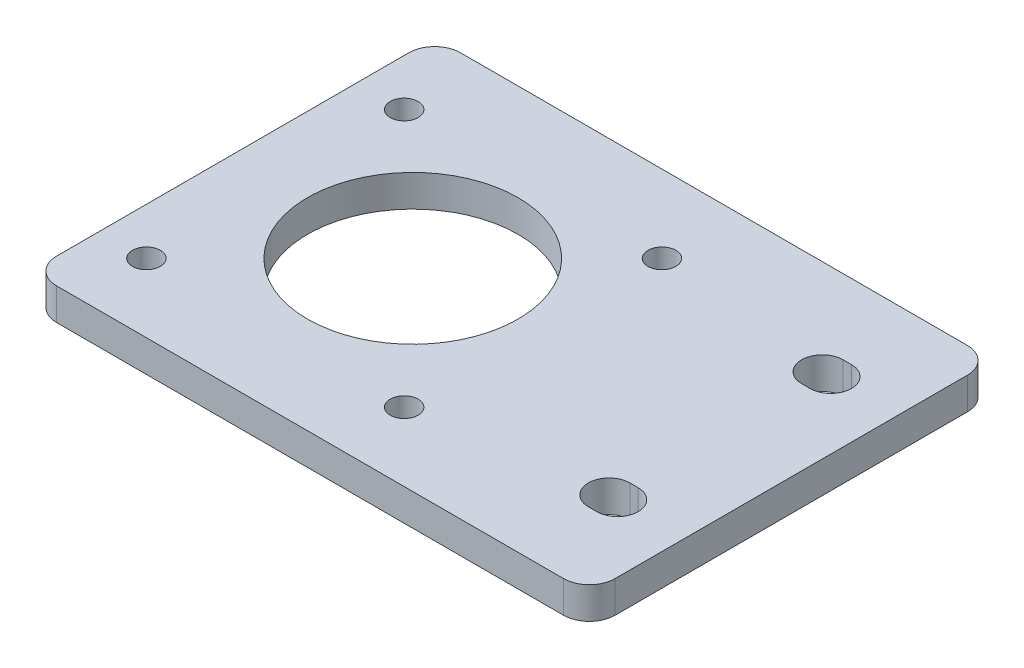
ISO-10303-21;
HEADER;
FILE_DESCRIPTION(('STEP AP214'),'2;1');
FILE_NAME('part.step','',(''),(''),'','','');
FILE_SCHEMA(('AUTOMOTIVE_DESIGN { 1 0 10303 214 1 1 1 1 }'));
ENDSEC;
DATA;
#1=APPLICATION_CONTEXT('core data for automotive mechanical design processes');
#2=APPLICATION_PROTOCOL_DEFINITION('international standard','automotive_design',2000,#1);
#3=PRODUCT_CONTEXT('',#1,'mechanical');
#4=PRODUCT('Part','Part','',(#3));
#5=PRODUCT_RELATED_PRODUCT_CATEGORY('part','',(#4));
#6=PRODUCT_DEFINITION_FORMATION('','',#4);
#7=PRODUCT_DEFINITION_CONTEXT('part definition',#1,'design');
#8=PRODUCT_DEFINITION('design','',#6,#7);
#9=PRODUCT_DEFINITION_SHAPE('','',#8);
#10=(LENGTH_UNIT() NAMED_UNIT(*) SI_UNIT(.MILLI.,.METRE.));
#11=(NAMED_UNIT(*) PLANE_ANGLE_UNIT() SI_UNIT($,.RADIAN.));
#12=(NAMED_UNIT(*) SI_UNIT($,.STERADIAN.) SOLID_ANGLE_UNIT());
#13=UNCERTAINTY_MEASURE_WITH_UNIT(LENGTH_MEASURE(1.E-05),#10,'distance_accuracy_value','');
#14=(GEOMETRIC_REPRESENTATION_CONTEXT(3) GLOBAL_UNCERTAINTY_ASSIGNED_CONTEXT((#13)) GLOBAL_UNIT_ASSIGNED_CONTEXT((#10,
#11,#12)) REPRESENTATION_CONTEXT('',''));
#15=CARTESIAN_POINT('',(0.,0.,0.));
#16=DIRECTION('',(0.,0.,1.));
#17=DIRECTION('',(1.,0.,0.));
#18=AXIS2_PLACEMENT_3D('',#15,#16,#17);
#19=CARTESIAN_POINT('',(0.,3.7,0.));
#20=DIRECTION('',(0.,-1.,0.));
#21=DIRECTION('',(0.,0.,-1.));
#22=AXIS2_PLACEMENT_3D('',#19,#20,#21);
#23=PLANE('',#22);
#24=CARTESIAN_POINT('',(39.3569900361446,3.7,1.63237025517979));
#25=DIRECTION('',(0.,1.,0.));
#26=DIRECTION('',(0.,0.,1.));
#27=AXIS2_PLACEMENT_3D('',#24,#25,#26);
#28=CIRCLE('',#27,2.41000000000001);
#29=CARTESIAN_POINT('',(39.3569900361446,3.7,-0.777629744820214));
#30=VERTEX_POINT('',#29);
#31=CARTESIAN_POINT('',(39.3569900361446,3.7,4.0423702551798));
#32=VERTEX_POINT('',#31);
#33=EDGE_CURVE('E190',#30,#32,#28,.T.);
#34=ORIENTED_EDGE('',*,*,#33,.F.);
#35=DIRECTION('',(-1.,0.,0.));
#36=VECTOR('',#35,1.);
#37=CARTESIAN_POINT('',(39.3569900361446,3.7,-0.777629744820214));
#38=LINE('',#37,#36);
#39=CARTESIAN_POINT('',(40.3369900361446,3.7,-0.777629744820207));
#40=VERTEX_POINT('',#39);
#41=EDGE_CURVE('E198',#40,#30,#38,.T.);
#42=ORIENTED_EDGE('',*,*,#41,.F.);
#43=CARTESIAN_POINT('',(40.3369900361446,3.7,1.63237025517979));
#44=DIRECTION('',(0.,1.,0.));
#45=DIRECTION('',(0.,0.,1.));
#46=AXIS2_PLACEMENT_3D('',#43,#44,#45);
#47=CIRCLE('',#46,2.41);
#48=CARTESIAN_POINT('',(40.3369900361446,3.7,4.04237025517979));
#49=VERTEX_POINT('',#48);
#50=EDGE_CURVE('E195',#49,#40,#47,.T.);
#51=ORIENTED_EDGE('',*,*,#50,.F.);
#52=DIRECTION('',(1.,0.,0.));
#53=VECTOR('',#52,1.);
#54=CARTESIAN_POINT('',(39.3569900361446,3.7,4.0423702551798));
#55=LINE('',#54,#53);
#56=EDGE_CURVE('E192',#32,#49,#55,.T.);
#57=ORIENTED_EDGE('',*,*,#56,.F.);
#58=EDGE_LOOP('',(#34,#42,#51,#57));
#59=FACE_BOUND('',#58,.T.);
#60=DIRECTION('',(-1.,0.,0.));
#61=VECTOR('',#60,1.);
#62=CARTESIAN_POINT('',(-16.8530099638554,3.7,-34.2776297448202));
#63=LINE('',#62,#61);
#64=CARTESIAN_POINT('',(45.1469900361446,3.7,-34.2776297448202));
#65=VERTEX_POINT('',#64);
#66=CARTESIAN_POINT('',(-13.8530099638554,3.7,-34.2776297448202));
#67=VERTEX_POINT('',#66);
#68=EDGE_CURVE('E259',#65,#67,#63,.T.);
#69=ORIENTED_EDGE('',*,*,#68,.T.);
#70=CARTESIAN_POINT('',(-13.8530099638554,3.7,-31.2776297448202));
#71=DIRECTION('',(0.,-1.,0.));
#72=DIRECTION('',(0.,0.,-1.));
#73=AXIS2_PLACEMENT_3D('',#70,#71,#72);
#74=CIRCLE('',#73,3.);
#75=CARTESIAN_POINT('',(-16.8530099638554,3.7,-31.2776297448202));
#76=VERTEX_POINT('',#75);
#77=EDGE_CURVE('E294',#67,#76,#74,.F.);
#78=ORIENTED_EDGE('',*,*,#77,.T.);
#79=DIRECTION('',(0.,0.,1.));
#80=VECTOR('',#79,1.);
#81=CARTESIAN_POINT('',(-16.8530099638554,3.7,12.7223702551798));
#82=LINE('',#81,#80);
#83=CARTESIAN_POINT('',(-16.8530099638554,3.7,9.72237025517979));
#84=VERTEX_POINT('',#83);
#85=EDGE_CURVE('E251',#76,#84,#82,.T.);
#86=ORIENTED_EDGE('',*,*,#85,.T.);
#87=CARTESIAN_POINT('',(-13.8530099638554,3.7,9.72237025517979));
#88=DIRECTION('',(0.,-1.,0.));
#89=DIRECTION('',(0.,0.,-1.));
#90=AXIS2_PLACEMENT_3D('',#87,#88,#89);
#91=CIRCLE('',#90,3.);
#92=CARTESIAN_POINT('',(-13.8530099638554,3.7,12.7223702551798));
#93=VERTEX_POINT('',#92);
#94=EDGE_CURVE('E290',#84,#93,#91,.F.);
#95=ORIENTED_EDGE('',*,*,#94,.T.);
#96=DIRECTION('',(1.,0.,0.));
#97=VECTOR('',#96,1.);
#98=CARTESIAN_POINT('',(-16.8530099638554,3.7,12.7223702551798));
#99=LINE('',#98,#97);
#100=CARTESIAN_POINT('',(45.1469900361446,3.7,12.7223702551798));
#101=VERTEX_POINT('',#100);
#102=EDGE_CURVE('E254',#93,#101,#99,.T.);
#103=ORIENTED_EDGE('',*,*,#102,.T.);
#104=CARTESIAN_POINT('',(45.1469900361446,3.7,9.72237025517979));
#105=DIRECTION('',(0.,-1.,0.));
#106=DIRECTION('',(0.,0.,-1.));
#107=AXIS2_PLACEMENT_3D('',#104,#105,#106);
#108=CIRCLE('',#107,3.);
#109=CARTESIAN_POINT('',(48.1469900361446,3.7,9.72237025517979));
#110=VERTEX_POINT('',#109);
#111=EDGE_CURVE('E55',#101,#110,#108,.F.);
#112=ORIENTED_EDGE('',*,*,#111,.T.);
#113=DIRECTION('',(0.,0.,-1.));
#114=VECTOR('',#113,1.);
#115=CARTESIAN_POINT('',(48.1469900361446,3.7,12.7223702551798));
#116=LINE('',#115,#114);
#117=CARTESIAN_POINT('',(48.1469900361446,3.7,-31.2776297448202));
#118=VERTEX_POINT('',#117);
#119=EDGE_CURVE('E257',#110,#118,#116,.T.);
#120=ORIENTED_EDGE('',*,*,#119,.T.);
#121=CARTESIAN_POINT('',(45.1469900361446,3.7,-31.2776297448202));
#122=DIRECTION('',(0.,-1.,0.));
#123=DIRECTION('',(0.,0.,-1.));
#124=AXIS2_PLACEMENT_3D('',#121,#122,#123);
#125=CIRCLE('',#124,3.);
#126=EDGE_CURVE('E292',#118,#65,#125,.F.);
#127=ORIENTED_EDGE('',*,*,#126,.T.);
#128=EDGE_LOOP('',(#69,#78,#86,#95,#103,#112,#120,#127));
#129=FACE_BOUND('',#128,.T.);
#130=CARTESIAN_POINT('',(4.09699003614461,3.7,-10.7776297448202));
#131=DIRECTION('',(0.,1.,0.));
#132=DIRECTION('',(0.,0.,1.));
#133=AXIS2_PLACEMENT_3D('',#130,#131,#132);
#134=CIRCLE('',#133,12.25);
#135=CARTESIAN_POINT('',(4.09699003614461,3.7,1.47237025517979));
#136=VERTEX_POINT('',#135);
#137=EDGE_CURVE('E245',#136,#136,#134,.T.);
#138=ORIENTED_EDGE('',*,*,#137,.F.);
#139=EDGE_LOOP('',(#138));
#140=FACE_BOUND('',#139,.T.);
#141=CARTESIAN_POINT('',(-11.4030099638554,3.7,4.72237025517979));
#142=DIRECTION('',(0.,1.,0.));
#143=DIRECTION('',(0.,0.,1.));
#144=AXIS2_PLACEMENT_3D('',#141,#142,#143);
#145=CIRCLE('',#144,1.62384984749867);
#146=CARTESIAN_POINT('',(-11.4030099638554,3.7,6.34622010267846));
#147=VERTEX_POINT('',#146);
#148=EDGE_CURVE('E239',#147,#147,#145,.T.);
#149=ORIENTED_EDGE('',*,*,#148,.F.);
#150=EDGE_LOOP('',(#149));
#151=FACE_BOUND('',#150,.T.);
#152=CARTESIAN_POINT('',(18.5969900361446,3.7,4.72237025517979));
#153=DIRECTION('',(0.,1.,0.));
#154=DIRECTION('',(0.,0.,1.));
#155=AXIS2_PLACEMENT_3D('',#152,#153,#154);
#156=CIRCLE('',#155,1.62384984749867);
#157=CARTESIAN_POINT('',(18.5969900361446,3.7,6.34622010267846));
#158=VERTEX_POINT('',#157);
#159=EDGE_CURVE('E233',#158,#158,#156,.T.);
#160=ORIENTED_EDGE('',*,*,#159,.F.);
#161=EDGE_LOOP('',(#160));
#162=FACE_BOUND('',#161,.T.);
#163=CARTESIAN_POINT('',(18.5969900361445,3.7,-25.2776297448202));
#164=DIRECTION('',(0.,1.,0.));
#165=DIRECTION('',(0.,0.,1.));
#166=AXIS2_PLACEMENT_3D('',#163,#164,#165);
#167=CIRCLE('',#166,1.62384984749867);
#168=CARTESIAN_POINT('',(18.5969900361445,3.7,-23.6537798973215));
#169=VERTEX_POINT('',#168);
#170=EDGE_CURVE('E227',#169,#169,#167,.T.);
#171=ORIENTED_EDGE('',*,*,#170,.F.);
#172=EDGE_LOOP('',(#171));
#173=FACE_BOUND('',#172,.T.);
#174=CARTESIAN_POINT('',(-11.4030099638555,3.7,-25.2776297448202));
#175=DIRECTION('',(0.,1.,0.));
#176=DIRECTION('',(0.,0.,1.));
#177=AXIS2_PLACEMENT_3D('',#174,#175,#176);
#178=CIRCLE('',#177,1.62384984749867);
#179=CARTESIAN_POINT('',(-11.4030099638555,3.7,-23.6537798973215));
#180=VERTEX_POINT('',#179);
#181=EDGE_CURVE('E221',#180,#180,#178,.T.);
#182=ORIENTED_EDGE('',*,*,#181,.F.);
#183=EDGE_LOOP('',(#182));
#184=FACE_BOUND('',#183,.T.);
#185=CARTESIAN_POINT('',(39.3569900361446,3.7,-23.1876297448202));
#186=DIRECTION('',(0.,1.,0.));
#187=DIRECTION('',(0.,0.,-1.));
#188=AXIS2_PLACEMENT_3D('',#185,#186,#187);
#189=CIRCLE('',#188,2.41);
#190=CARTESIAN_POINT('',(39.3569900361446,3.7,-25.5976297448202));
#191=VERTEX_POINT('',#190);
#192=CARTESIAN_POINT('',(39.3569900361446,3.7,-20.7776297448202));
#193=VERTEX_POINT('',#192);
#194=EDGE_CURVE('E149',#191,#193,#189,.T.);
#195=ORIENTED_EDGE('',*,*,#194,.F.);
#196=DIRECTION('',(-1.,0.,0.));
#197=VECTOR('',#196,1.);
#198=CARTESIAN_POINT('',(39.3569900361446,3.7,-25.5976297448202));
#199=LINE('',#198,#197);
#200=CARTESIAN_POINT('',(40.3369900361446,3.7,-25.5976297448202));
#201=VERTEX_POINT('',#200);
#202=EDGE_CURVE('E174',#201,#191,#199,.T.);
#203=ORIENTED_EDGE('',*,*,#202,.F.);
#204=CARTESIAN_POINT('',(40.3369900361446,3.7,-23.1876297448202));
#205=DIRECTION('',(0.,1.,0.));
#206=DIRECTION('',(0.,0.,-1.));
#207=AXIS2_PLACEMENT_3D('',#204,#205,#206);
#208=CIRCLE('',#207,2.41);
#209=CARTESIAN_POINT('',(40.3369900361446,3.7,-20.7776297448202));
#210=VERTEX_POINT('',#209);
#211=EDGE_CURVE('E172',#210,#201,#208,.T.);
#212=ORIENTED_EDGE('',*,*,#211,.F.);
#213=DIRECTION('',(1.,0.,0.));
#214=VECTOR('',#213,1.);
#215=CARTESIAN_POINT('',(39.3569900361446,3.7,-20.7776297448202));
#216=LINE('',#215,#214);
#217=EDGE_CURVE('E159',#193,#210,#216,.T.);
#218=ORIENTED_EDGE('',*,*,#217,.F.);
#219=EDGE_LOOP('',(#195,#203,#212,#218));
#220=FACE_BOUND('',#219,.T.);
#221=ADVANCED_FACE('F33',(#59,#129,#140,#151,#162,#173,#184,#220),#23,.F.);
#222=CARTESIAN_POINT('',(0.,0.,0.));
#223=DIRECTION('',(0.,-1.,0.));
#224=DIRECTION('',(0.,0.,-1.));
#225=AXIS2_PLACEMENT_3D('',#222,#223,#224);
#226=PLANE('',#225);
#227=CARTESIAN_POINT('',(18.5969900361445,0.,-25.2776297448202));
#228=DIRECTION('',(0.,1.,0.));
#229=DIRECTION('',(0.,0.,1.));
#230=AXIS2_PLACEMENT_3D('',#227,#228,#229);
#231=CIRCLE('',#230,1.62384984749867);
#232=CARTESIAN_POINT('',(18.5969900361445,0.,-23.6537798973215));
#233=VERTEX_POINT('',#232);
#234=EDGE_CURVE('E224',#233,#233,#231,.T.);
#235=ORIENTED_EDGE('',*,*,#234,.T.);
#236=EDGE_LOOP('',(#235));
#237=FACE_BOUND('',#236,.T.);
#238=CARTESIAN_POINT('',(-11.4030099638554,0.,4.72237025517979));
#239=DIRECTION('',(0.,1.,0.));
#240=DIRECTION('',(0.,0.,1.));
#241=AXIS2_PLACEMENT_3D('',#238,#239,#240);
#242=CIRCLE('',#241,1.62384984749867);
#243=CARTESIAN_POINT('',(-11.4030099638554,0.,6.34622010267846));
#244=VERTEX_POINT('',#243);
#245=EDGE_CURVE('E236',#244,#244,#242,.T.);
#246=ORIENTED_EDGE('',*,*,#245,.T.);
#247=EDGE_LOOP('',(#246));
#248=FACE_BOUND('',#247,.T.);
#249=DIRECTION('',(0.,0.,1.));
#250=VECTOR('',#249,1.);
#251=CARTESIAN_POINT('',(-16.8530099638554,0.,12.7223702551798));
#252=LINE('',#251,#250);
#253=CARTESIAN_POINT('',(-16.8530099638554,0.,-31.2776297448202));
#254=VERTEX_POINT('',#253);
#255=CARTESIAN_POINT('',(-16.8530099638554,0.,9.72237025517979));
#256=VERTEX_POINT('',#255);
#257=EDGE_CURVE('E248',#254,#256,#252,.T.);
#258=ORIENTED_EDGE('',*,*,#257,.F.);
#259=CARTESIAN_POINT('',(-13.8530099638554,0.,-31.2776297448202));
#260=DIRECTION('',(0.,-1.,0.));
#261=DIRECTION('',(0.,0.,-1.));
#262=AXIS2_PLACEMENT_3D('',#259,#260,#261);
#263=CIRCLE('',#262,3.);
#264=CARTESIAN_POINT('',(-13.8530099638554,0.,-34.2776297448202));
#265=VERTEX_POINT('',#264);
#266=EDGE_CURVE('E282',#254,#265,#263,.T.);
#267=ORIENTED_EDGE('',*,*,#266,.T.);
#268=DIRECTION('',(-1.,0.,0.));
#269=VECTOR('',#268,1.);
#270=CARTESIAN_POINT('',(-16.8530099638554,0.,-34.2776297448202));
#271=LINE('',#270,#269);
#272=CARTESIAN_POINT('',(45.1469900361446,0.,-34.2776297448202));
#273=VERTEX_POINT('',#272);
#274=EDGE_CURVE('E255',#273,#265,#271,.T.);
#275=ORIENTED_EDGE('',*,*,#274,.F.);
#276=CARTESIAN_POINT('',(45.1469900361446,0.,-31.2776297448202));
#277=DIRECTION('',(0.,-1.,0.));
#278=DIRECTION('',(0.,0.,-1.));
#279=AXIS2_PLACEMENT_3D('',#276,#277,#278);
#280=CIRCLE('',#279,3.);
#281=CARTESIAN_POINT('',(48.1469900361446,0.,-31.2776297448202));
#282=VERTEX_POINT('',#281);
#283=EDGE_CURVE('E280',#273,#282,#280,.T.);
#284=ORIENTED_EDGE('',*,*,#283,.T.);
#285=DIRECTION('',(0.,0.,-1.));
#286=VECTOR('',#285,1.);
#287=CARTESIAN_POINT('',(48.1469900361446,0.,12.7223702551798));
#288=LINE('',#287,#286);
#289=CARTESIAN_POINT('',(48.1469900361446,0.,9.72237025517979));
#290=VERTEX_POINT('',#289);
#291=EDGE_CURVE('E268',#290,#282,#288,.T.);
#292=ORIENTED_EDGE('',*,*,#291,.F.);
#293=CARTESIAN_POINT('',(45.1469900361446,0.,9.72237025517979));
#294=DIRECTION('',(0.,-1.,0.));
#295=DIRECTION('',(0.,0.,-1.));
#296=AXIS2_PLACEMENT_3D('',#293,#294,#295);
#297=CIRCLE('',#296,3.);
#298=CARTESIAN_POINT('',(45.1469900361446,0.,12.7223702551798));
#299=VERTEX_POINT('',#298);
#300=EDGE_CURVE('E276',#290,#299,#297,.T.);
#301=ORIENTED_EDGE('',*,*,#300,.T.);
#302=DIRECTION('',(1.,0.,0.));
#303=VECTOR('',#302,1.);
#304=CARTESIAN_POINT('',(-16.8530099638554,0.,12.7223702551798));
#305=LINE('',#304,#303);
#306=CARTESIAN_POINT('',(-13.8530099638554,0.,12.7223702551798));
#307=VERTEX_POINT('',#306);
#308=EDGE_CURVE('E265',#307,#299,#305,.T.);
#309=ORIENTED_EDGE('',*,*,#308,.F.);
#310=CARTESIAN_POINT('',(-13.8530099638554,0.,9.72237025517979));
#311=DIRECTION('',(0.,-1.,0.));
#312=DIRECTION('',(0.,0.,-1.));
#313=AXIS2_PLACEMENT_3D('',#310,#311,#312);
#314=CIRCLE('',#313,3.);
#315=EDGE_CURVE('E278',#307,#256,#314,.T.);
#316=ORIENTED_EDGE('',*,*,#315,.T.);
#317=EDGE_LOOP('',(#258,#267,#275,#284,#292,#301,#309,#316));
#318=FACE_BOUND('',#317,.T.);
#319=CARTESIAN_POINT('',(4.09699003614461,0.,-10.7776297448202));
#320=DIRECTION('',(0.,1.,0.));
#321=DIRECTION('',(0.,0.,1.));
#322=AXIS2_PLACEMENT_3D('',#319,#320,#321);
#323=CIRCLE('',#322,12.25);
#324=CARTESIAN_POINT('',(4.09699003614461,0.,1.47237025517979));
#325=VERTEX_POINT('',#324);
#326=EDGE_CURVE('E242',#325,#325,#323,.T.);
#327=ORIENTED_EDGE('',*,*,#326,.T.);
#328=EDGE_LOOP('',(#327));
#329=FACE_BOUND('',#328,.T.);
#330=CARTESIAN_POINT('',(18.5969900361446,0.,4.72237025517979));
#331=DIRECTION('',(0.,1.,0.));
#332=DIRECTION('',(0.,0.,1.));
#333=AXIS2_PLACEMENT_3D('',#330,#331,#332);
#334=CIRCLE('',#333,1.62384984749867);
#335=CARTESIAN_POINT('',(18.5969900361446,0.,6.34622010267846));
#336=VERTEX_POINT('',#335);
#337=EDGE_CURVE('E230',#336,#336,#334,.T.);
#338=ORIENTED_EDGE('',*,*,#337,.T.);
#339=EDGE_LOOP('',(#338));
#340=FACE_BOUND('',#339,.T.);
#341=CARTESIAN_POINT('',(-11.4030099638555,0.,-25.2776297448202));
#342=DIRECTION('',(0.,1.,0.));
#343=DIRECTION('',(0.,0.,1.));
#344=AXIS2_PLACEMENT_3D('',#341,#342,#343);
#345=CIRCLE('',#344,1.62384984749867);
#346=CARTESIAN_POINT('',(-11.4030099638555,0.,-23.6537798973215));
#347=VERTEX_POINT('',#346);
#348=EDGE_CURVE('E220',#347,#347,#345,.T.);
#349=ORIENTED_EDGE('',*,*,#348,.T.);
#350=EDGE_LOOP('',(#349));
#351=FACE_BOUND('',#350,.T.);
#352=DIRECTION('',(-1.,0.,0.));
#353=VECTOR('',#352,1.);
#354=CARTESIAN_POINT('',(39.3569900361446,0.,-0.777629744820214));
#355=LINE('',#354,#353);
#356=CARTESIAN_POINT('',(40.3369900361446,0.,-0.777629744820207));
#357=VERTEX_POINT('',#356);
#358=CARTESIAN_POINT('',(39.3569900361446,0.,-0.777629744820214));
#359=VERTEX_POINT('',#358);
#360=EDGE_CURVE('E193',#357,#359,#355,.T.);
#361=ORIENTED_EDGE('',*,*,#360,.T.);
#362=CARTESIAN_POINT('',(39.3569900361446,0.,1.63237025517979));
#363=DIRECTION('',(0.,1.,0.));
#364=DIRECTION('',(0.,0.,1.));
#365=AXIS2_PLACEMENT_3D('',#362,#363,#364);
#366=CIRCLE('',#365,2.41000000000001);
#367=CARTESIAN_POINT('',(39.3569900361446,0.,4.0423702551798));
#368=VERTEX_POINT('',#367);
#369=EDGE_CURVE('E167',#359,#368,#366,.T.);
#370=ORIENTED_EDGE('',*,*,#369,.T.);
#371=DIRECTION('',(1.,0.,0.));
#372=VECTOR('',#371,1.);
#373=CARTESIAN_POINT('',(39.3569900361446,0.,4.0423702551798));
#374=LINE('',#373,#372);
#375=CARTESIAN_POINT('',(40.3369900361446,0.,4.04237025517979));
#376=VERTEX_POINT('',#375);
#377=EDGE_CURVE('E203',#368,#376,#374,.T.);
#378=ORIENTED_EDGE('',*,*,#377,.T.);
#379=CARTESIAN_POINT('',(40.3369900361446,0.,1.63237025517979));
#380=DIRECTION('',(0.,1.,0.));
#381=DIRECTION('',(0.,0.,1.));
#382=AXIS2_PLACEMENT_3D('',#379,#380,#381);
#383=CIRCLE('',#382,2.41);
#384=EDGE_CURVE('E206',#376,#357,#383,.T.);
#385=ORIENTED_EDGE('',*,*,#384,.T.);
#386=EDGE_LOOP('',(#361,#370,#378,#385));
#387=FACE_BOUND('',#386,.T.);
#388=DIRECTION('',(-1.,0.,0.));
#389=VECTOR('',#388,1.);
#390=CARTESIAN_POINT('',(39.3569900361446,0.,-25.5976297448202));
#391=LINE('',#390,#389);
#392=CARTESIAN_POINT('',(40.3369900361446,0.,-25.5976297448202));
#393=VERTEX_POINT('',#392);
#394=CARTESIAN_POINT('',(39.3569900361446,0.,-25.5976297448202));
#395=VERTEX_POINT('',#394);
#396=EDGE_CURVE('E160',#393,#395,#391,.T.);
#397=ORIENTED_EDGE('',*,*,#396,.T.);
#398=CARTESIAN_POINT('',(39.3569900361446,0.,-23.1876297448202));
#399=DIRECTION('',(0.,1.,0.));
#400=DIRECTION('',(0.,0.,-1.));
#401=AXIS2_PLACEMENT_3D('',#398,#399,#400);
#402=CIRCLE('',#401,2.41);
#403=CARTESIAN_POINT('',(39.3569900361446,0.,-20.7776297448202));
#404=VERTEX_POINT('',#403);
#405=EDGE_CURVE('E178',#395,#404,#402,.T.);
#406=ORIENTED_EDGE('',*,*,#405,.T.);
#407=DIRECTION('',(1.,0.,0.));
#408=VECTOR('',#407,1.);
#409=CARTESIAN_POINT('',(39.3569900361446,0.,-20.7776297448202));
#410=LINE('',#409,#408);
#411=CARTESIAN_POINT('',(40.3369900361446,0.,-20.7776297448202));
#412=VERTEX_POINT('',#411);
#413=EDGE_CURVE('E166',#404,#412,#410,.T.);
#414=ORIENTED_EDGE('',*,*,#413,.T.);
#415=CARTESIAN_POINT('',(40.3369900361446,0.,-23.1876297448202));
#416=DIRECTION('',(0.,1.,0.));
#417=DIRECTION('',(0.,0.,-1.));
#418=AXIS2_PLACEMENT_3D('',#415,#416,#417);
#419=CIRCLE('',#418,2.41);
#420=EDGE_CURVE('E181',#412,#393,#419,.T.);
#421=ORIENTED_EDGE('',*,*,#420,.T.);
#422=EDGE_LOOP('',(#397,#406,#414,#421));
#423=FACE_BOUND('',#422,.T.);
#424=ADVANCED_FACE('F313',(#237,#248,#318,#329,#340,#351,#387,#423),#226,.T.);
#425=CARTESIAN_POINT('',(-16.8530099638554,3.7,12.7223702551798));
#426=DIRECTION('',(1.,0.,0.));
#427=DIRECTION('',(0.,0.,-1.));
#428=AXIS2_PLACEMENT_3D('',#425,#426,#427);
#429=PLANE('',#428);
#430=ORIENTED_EDGE('',*,*,#85,.F.);
#431=DIRECTION('',(0.,-1.,0.));
#432=VECTOR('',#431,1.);
#433=CARTESIAN_POINT('',(-16.8530099638554,3.7,-31.2776297448202));
#434=LINE('',#433,#432);
#435=EDGE_CURVE('E273',#76,#254,#434,.T.);
#436=ORIENTED_EDGE('',*,*,#435,.T.);
#437=ORIENTED_EDGE('',*,*,#257,.T.);
#438=DIRECTION('',(0.,-1.,0.));
#439=VECTOR('',#438,1.);
#440=CARTESIAN_POINT('',(-16.8530099638554,3.7,9.72237025517979));
#441=LINE('',#440,#439);
#442=EDGE_CURVE('E262',#256,#84,#441,.F.);
#443=ORIENTED_EDGE('',*,*,#442,.T.);
#444=EDGE_LOOP('',(#430,#436,#437,#443));
#445=FACE_BOUND('',#444,.T.);
#446=ADVANCED_FACE('F330',(#445),#429,.F.);
#447=CARTESIAN_POINT('',(-16.8530099638554,3.7,12.7223702551798));
#448=DIRECTION('',(0.,0.,-1.));
#449=DIRECTION('',(-1.,0.,0.));
#450=AXIS2_PLACEMENT_3D('',#447,#448,#449);
#451=PLANE('',#450);
#452=ORIENTED_EDGE('',*,*,#102,.F.);
#453=DIRECTION('',(0.,-1.,0.));
#454=VECTOR('',#453,1.);
#455=CARTESIAN_POINT('',(-13.8530099638554,3.7,12.7223702551798));
#456=LINE('',#455,#454);
#457=EDGE_CURVE('E11',#93,#307,#456,.T.);
#458=ORIENTED_EDGE('',*,*,#457,.T.);
#459=ORIENTED_EDGE('',*,*,#308,.T.);
#460=DIRECTION('',(0.,-1.,0.));
#461=VECTOR('',#460,1.);
#462=CARTESIAN_POINT('',(45.1469900361446,3.7,12.7223702551798));
#463=LINE('',#462,#461);
#464=EDGE_CURVE('E41',#299,#101,#463,.F.);
#465=ORIENTED_EDGE('',*,*,#464,.T.);
#466=EDGE_LOOP('',(#452,#458,#459,#465));
#467=FACE_BOUND('',#466,.T.);
#468=ADVANCED_FACE('F302',(#467),#451,.F.);
#469=CARTESIAN_POINT('',(48.1469900361446,3.7,12.7223702551798));
#470=DIRECTION('',(-1.,0.,0.));
#471=DIRECTION('',(0.,0.,1.));
#472=AXIS2_PLACEMENT_3D('',#469,#470,#471);
#473=PLANE('',#472);
#474=ORIENTED_EDGE('',*,*,#291,.T.);
#475=DIRECTION('',(0.,-1.,0.));
#476=VECTOR('',#475,1.);
#477=CARTESIAN_POINT('',(48.1469900361446,3.7,-31.2776297448202));
#478=LINE('',#477,#476);
#479=EDGE_CURVE('E48',#282,#118,#478,.F.);
#480=ORIENTED_EDGE('',*,*,#479,.T.);
#481=ORIENTED_EDGE('',*,*,#119,.F.);
#482=DIRECTION('',(0.,-1.,0.));
#483=VECTOR('',#482,1.);
#484=CARTESIAN_POINT('',(48.1469900361446,3.7,9.72237025517979));
#485=LINE('',#484,#483);
#486=EDGE_CURVE('E296',#110,#290,#485,.T.);
#487=ORIENTED_EDGE('',*,*,#486,.T.);
#488=EDGE_LOOP('',(#474,#480,#481,#487));
#489=FACE_BOUND('',#488,.T.);
#490=ADVANCED_FACE('F310',(#489),#473,.F.);
#491=CARTESIAN_POINT('',(-16.8530099638554,3.7,-34.2776297448202));
#492=DIRECTION('',(0.,0.,1.));
#493=DIRECTION('',(1.,0.,0.));
#494=AXIS2_PLACEMENT_3D('',#491,#492,#493);
#495=PLANE('',#494);
#496=ORIENTED_EDGE('',*,*,#274,.T.);
#497=DIRECTION('',(0.,-1.,0.));
#498=VECTOR('',#497,1.);
#499=CARTESIAN_POINT('',(-13.8530099638554,3.7,-34.2776297448202));
#500=LINE('',#499,#498);
#501=EDGE_CURVE('E287',#265,#67,#500,.F.);
#502=ORIENTED_EDGE('',*,*,#501,.T.);
#503=ORIENTED_EDGE('',*,*,#68,.F.);
#504=DIRECTION('',(0.,-1.,0.));
#505=VECTOR('',#504,1.);
#506=CARTESIAN_POINT('',(45.1469900361446,3.7,-34.2776297448202));
#507=LINE('',#506,#505);
#508=EDGE_CURVE('E284',#65,#273,#507,.T.);
#509=ORIENTED_EDGE('',*,*,#508,.T.);
#510=EDGE_LOOP('',(#496,#502,#503,#509));
#511=FACE_BOUND('',#510,.T.);
#512=ADVANCED_FACE('F322',(#511),#495,.F.);
#513=CARTESIAN_POINT('',(4.09699003614461,3.7,-10.7776297448202));
#514=DIRECTION('',(0.,-1.,0.));
#515=DIRECTION('',(0.,0.,-1.));
#516=AXIS2_PLACEMENT_3D('',#513,#514,#515);
#517=CYLINDRICAL_SURFACE('',#516,12.25);
#518=ORIENTED_EDGE('',*,*,#137,.T.);
#519=EDGE_LOOP('',(#518));
#520=FACE_BOUND('',#519,.T.);
#521=ORIENTED_EDGE('',*,*,#326,.F.);
#522=EDGE_LOOP('',(#521));
#523=FACE_BOUND('',#522,.T.);
#524=ADVANCED_FACE('F350',(#520,#523),#517,.F.);
#525=CARTESIAN_POINT('',(-11.4030099638554,3.7,4.72237025517979));
#526=DIRECTION('',(0.,-1.,0.));
#527=DIRECTION('',(0.,0.,-1.));
#528=AXIS2_PLACEMENT_3D('',#525,#526,#527);
#529=CYLINDRICAL_SURFACE('',#528,1.62384984749867);
#530=ORIENTED_EDGE('',*,*,#148,.T.);
#531=EDGE_LOOP('',(#530));
#532=FACE_BOUND('',#531,.T.);
#533=ORIENTED_EDGE('',*,*,#245,.F.);
#534=EDGE_LOOP('',(#533));
#535=FACE_BOUND('',#534,.T.);
#536=ADVANCED_FACE('F406',(#532,#535),#529,.F.);
#537=CARTESIAN_POINT('',(18.5969900361446,3.7,4.72237025517979));
#538=DIRECTION('',(0.,-1.,0.));
#539=DIRECTION('',(0.,0.,-1.));
#540=AXIS2_PLACEMENT_3D('',#537,#538,#539);
#541=CYLINDRICAL_SURFACE('',#540,1.62384984749867);
#542=ORIENTED_EDGE('',*,*,#159,.T.);
#543=EDGE_LOOP('',(#542));
#544=FACE_BOUND('',#543,.T.);
#545=ORIENTED_EDGE('',*,*,#337,.F.);
#546=EDGE_LOOP('',(#545));
#547=FACE_BOUND('',#546,.T.);
#548=ADVANCED_FACE('F403',(#544,#547),#541,.F.);
#549=CARTESIAN_POINT('',(18.5969900361445,3.7,-25.2776297448202));
#550=DIRECTION('',(0.,-1.,0.));
#551=DIRECTION('',(0.,0.,-1.));
#552=AXIS2_PLACEMENT_3D('',#549,#550,#551);
#553=CYLINDRICAL_SURFACE('',#552,1.62384984749867);
#554=ORIENTED_EDGE('',*,*,#170,.T.);
#555=EDGE_LOOP('',(#554));
#556=FACE_BOUND('',#555,.T.);
#557=ORIENTED_EDGE('',*,*,#234,.F.);
#558=EDGE_LOOP('',(#557));
#559=FACE_BOUND('',#558,.T.);
#560=ADVANCED_FACE('F399',(#556,#559),#553,.F.);
#561=CARTESIAN_POINT('',(-11.4030099638555,3.7,-25.2776297448202));
#562=DIRECTION('',(0.,-1.,0.));
#563=DIRECTION('',(0.,0.,-1.));
#564=AXIS2_PLACEMENT_3D('',#561,#562,#563);
#565=CYLINDRICAL_SURFACE('',#564,1.62384984749867);
#566=ORIENTED_EDGE('',*,*,#181,.T.);
#567=EDGE_LOOP('',(#566));
#568=FACE_BOUND('',#567,.T.);
#569=ORIENTED_EDGE('',*,*,#348,.F.);
#570=EDGE_LOOP('',(#569));
#571=FACE_BOUND('',#570,.T.);
#572=ADVANCED_FACE('F395',(#568,#571),#565,.F.);
#573=CARTESIAN_POINT('',(39.3569900361446,3.7,1.63237025517979));
#574=DIRECTION('',(0.,-1.,0.));
#575=DIRECTION('',(0.,0.,-1.));
#576=AXIS2_PLACEMENT_3D('',#573,#574,#575);
#577=CYLINDRICAL_SURFACE('',#576,2.41000000000001);
#578=ORIENTED_EDGE('',*,*,#369,.F.);
#579=DIRECTION('',(0.,-1.,0.));
#580=VECTOR('',#579,1.);
#581=CARTESIAN_POINT('',(39.3569900361446,3.7,-0.777629744820214));
#582=LINE('',#581,#580);
#583=EDGE_CURVE('E200',#30,#359,#582,.T.);
#584=ORIENTED_EDGE('',*,*,#583,.F.);
#585=ORIENTED_EDGE('',*,*,#33,.T.);
#586=DIRECTION('',(0.,-1.,0.));
#587=VECTOR('',#586,1.);
#588=CARTESIAN_POINT('',(39.3569900361446,3.7,4.0423702551798));
#589=LINE('',#588,#587);
#590=EDGE_CURVE('E217',#32,#368,#589,.T.);
#591=ORIENTED_EDGE('',*,*,#590,.T.);
#592=EDGE_LOOP('',(#578,#584,#585,#591));
#593=FACE_BOUND('',#592,.T.);
#594=ADVANCED_FACE('F391',(#593),#577,.F.);
#595=CARTESIAN_POINT('',(39.3569900361446,3.7,4.0423702551798));
#596=DIRECTION('',(0.,0.,-1.));
#597=DIRECTION('',(-1.,0.,0.));
#598=AXIS2_PLACEMENT_3D('',#595,#596,#597);
#599=PLANE('',#598);
#600=ORIENTED_EDGE('',*,*,#377,.F.);
#601=ORIENTED_EDGE('',*,*,#590,.F.);
#602=ORIENTED_EDGE('',*,*,#56,.T.);
#603=DIRECTION('',(0.,-1.,0.));
#604=VECTOR('',#603,1.);
#605=CARTESIAN_POINT('',(40.3369900361446,3.7,4.04237025517979));
#606=LINE('',#605,#604);
#607=EDGE_CURVE('E215',#49,#376,#606,.T.);
#608=ORIENTED_EDGE('',*,*,#607,.T.);
#609=EDGE_LOOP('',(#600,#601,#602,#608));
#610=FACE_BOUND('',#609,.T.);
#611=ADVANCED_FACE('F387',(#610),#599,.T.);
#612=CARTESIAN_POINT('',(40.3369900361446,3.7,1.63237025517979));
#613=DIRECTION('',(0.,-1.,0.));
#614=DIRECTION('',(0.,0.,-1.));
#615=AXIS2_PLACEMENT_3D('',#612,#613,#614);
#616=CYLINDRICAL_SURFACE('',#615,2.41);
#617=ORIENTED_EDGE('',*,*,#384,.F.);
#618=ORIENTED_EDGE('',*,*,#607,.F.);
#619=ORIENTED_EDGE('',*,*,#50,.T.);
#620=DIRECTION('',(0.,-1.,0.));
#621=VECTOR('',#620,1.);
#622=CARTESIAN_POINT('',(40.3369900361446,3.7,-0.777629744820207));
#623=LINE('',#622,#621);
#624=EDGE_CURVE('E213',#40,#357,#623,.T.);
#625=ORIENTED_EDGE('',*,*,#624,.T.);
#626=EDGE_LOOP('',(#617,#618,#619,#625));
#627=FACE_BOUND('',#626,.T.);
#628=ADVANCED_FACE('F383',(#627),#616,.F.);
#629=CARTESIAN_POINT('',(39.3569900361446,3.7,-0.777629744820214));
#630=DIRECTION('',(0.,0.,1.));
#631=DIRECTION('',(1.,0.,0.));
#632=AXIS2_PLACEMENT_3D('',#629,#630,#631);
#633=PLANE('',#632);
#634=ORIENTED_EDGE('',*,*,#360,.F.);
#635=ORIENTED_EDGE('',*,*,#624,.F.);
#636=ORIENTED_EDGE('',*,*,#41,.T.);
#637=ORIENTED_EDGE('',*,*,#583,.T.);
#638=EDGE_LOOP('',(#634,#635,#636,#637));
#639=FACE_BOUND('',#638,.T.);
#640=ADVANCED_FACE('F380',(#639),#633,.T.);
#641=CARTESIAN_POINT('',(39.3569900361446,3.7,-23.1876297448202));
#642=DIRECTION('',(0.,-1.,0.));
#643=DIRECTION('',(0.,0.,-1.));
#644=AXIS2_PLACEMENT_3D('',#641,#642,#643);
#645=CYLINDRICAL_SURFACE('',#644,2.41);
#646=ORIENTED_EDGE('',*,*,#405,.F.);
#647=DIRECTION('',(0.,-1.,0.));
#648=VECTOR('',#647,1.);
#649=CARTESIAN_POINT('',(39.3569900361446,3.7,-25.5976297448202));
#650=LINE('',#649,#648);
#651=EDGE_CURVE('E155',#191,#395,#650,.T.);
#652=ORIENTED_EDGE('',*,*,#651,.F.);
#653=ORIENTED_EDGE('',*,*,#194,.T.);
#654=DIRECTION('',(0.,-1.,0.));
#655=VECTOR('',#654,1.);
#656=CARTESIAN_POINT('',(39.3569900361446,3.7,-20.7776297448202));
#657=LINE('',#656,#655);
#658=EDGE_CURVE('E152',#193,#404,#657,.T.);
#659=ORIENTED_EDGE('',*,*,#658,.T.);
#660=EDGE_LOOP('',(#646,#652,#653,#659));
#661=FACE_BOUND('',#660,.T.);
#662=ADVANCED_FACE('F151',(#661),#645,.F.);
#663=CARTESIAN_POINT('',(39.3569900361446,3.7,-20.7776297448202));
#664=DIRECTION('',(0.,0.,-1.));
#665=DIRECTION('',(-1.,0.,0.));
#666=AXIS2_PLACEMENT_3D('',#663,#664,#665);
#667=PLANE('',#666);
#668=ORIENTED_EDGE('',*,*,#413,.F.);
#669=ORIENTED_EDGE('',*,*,#658,.F.);
#670=ORIENTED_EDGE('',*,*,#217,.T.);
#671=DIRECTION('',(0.,-1.,0.));
#672=VECTOR('',#671,1.);
#673=CARTESIAN_POINT('',(40.3369900361446,3.7,-20.7776297448202));
#674=LINE('',#673,#672);
#675=EDGE_CURVE('E168',#210,#412,#674,.T.);
#676=ORIENTED_EDGE('',*,*,#675,.T.);
#677=EDGE_LOOP('',(#668,#669,#670,#676));
#678=FACE_BOUND('',#677,.T.);
#679=ADVANCED_FACE('F163',(#678),#667,.T.);
#680=CARTESIAN_POINT('',(40.3369900361446,3.7,-23.1876297448202));
#681=DIRECTION('',(0.,-1.,0.));
#682=DIRECTION('',(0.,0.,-1.));
#683=AXIS2_PLACEMENT_3D('',#680,#681,#682);
#684=CYLINDRICAL_SURFACE('',#683,2.41);
#685=ORIENTED_EDGE('',*,*,#420,.F.);
#686=ORIENTED_EDGE('',*,*,#675,.F.);
#687=ORIENTED_EDGE('',*,*,#211,.T.);
#688=DIRECTION('',(0.,-1.,0.));
#689=VECTOR('',#688,1.);
#690=CARTESIAN_POINT('',(40.3369900361446,3.7,-25.5976297448202));
#691=LINE('',#690,#689);
#692=EDGE_CURVE('E187',#201,#393,#691,.T.);
#693=ORIENTED_EDGE('',*,*,#692,.T.);
#694=EDGE_LOOP('',(#685,#686,#687,#693));
#695=FACE_BOUND('',#694,.T.);
#696=ADVANCED_FACE('F366',(#695),#684,.F.);
#697=CARTESIAN_POINT('',(39.3569900361446,3.7,-25.5976297448202));
#698=DIRECTION('',(0.,0.,1.));
#699=DIRECTION('',(1.,0.,0.));
#700=AXIS2_PLACEMENT_3D('',#697,#698,#699);
#701=PLANE('',#700);
#702=ORIENTED_EDGE('',*,*,#396,.F.);
#703=ORIENTED_EDGE('',*,*,#692,.F.);
#704=ORIENTED_EDGE('',*,*,#202,.T.);
#705=ORIENTED_EDGE('',*,*,#651,.T.);
#706=EDGE_LOOP('',(#702,#703,#704,#705));
#707=FACE_BOUND('',#706,.T.);
#708=ADVANCED_FACE('F362',(#707),#701,.T.);
#709=CARTESIAN_POINT('',(-13.8530099638554,3.7,-31.2776297448202));
#710=DIRECTION('',(0.,-1.,0.));
#711=DIRECTION('',(0.,0.,-1.));
#712=AXIS2_PLACEMENT_3D('',#709,#710,#711);
#713=CYLINDRICAL_SURFACE('',#712,3.);
#714=ORIENTED_EDGE('',*,*,#77,.F.);
#715=ORIENTED_EDGE('',*,*,#501,.F.);
#716=ORIENTED_EDGE('',*,*,#266,.F.);
#717=ORIENTED_EDGE('',*,*,#435,.F.);
#718=EDGE_LOOP('',(#714,#715,#716,#717));
#719=FACE_BOUND('',#718,.T.);
#720=ADVANCED_FACE('F328',(#719),#713,.T.);
#721=CARTESIAN_POINT('',(45.1469900361446,3.7,-31.2776297448202));
#722=DIRECTION('',(0.,-1.,0.));
#723=DIRECTION('',(0.,0.,-1.));
#724=AXIS2_PLACEMENT_3D('',#721,#722,#723);
#725=CYLINDRICAL_SURFACE('',#724,3.);
#726=ORIENTED_EDGE('',*,*,#126,.F.);
#727=ORIENTED_EDGE('',*,*,#479,.F.);
#728=ORIENTED_EDGE('',*,*,#283,.F.);
#729=ORIENTED_EDGE('',*,*,#508,.F.);
#730=EDGE_LOOP('',(#726,#727,#728,#729));
#731=FACE_BOUND('',#730,.T.);
#732=ADVANCED_FACE('F319',(#731),#725,.T.);
#733=CARTESIAN_POINT('',(-13.8530099638554,3.7,9.72237025517979));
#734=DIRECTION('',(0.,-1.,0.));
#735=DIRECTION('',(0.,0.,-1.));
#736=AXIS2_PLACEMENT_3D('',#733,#734,#735);
#737=CYLINDRICAL_SURFACE('',#736,3.);
#738=ORIENTED_EDGE('',*,*,#94,.F.);
#739=ORIENTED_EDGE('',*,*,#442,.F.);
#740=ORIENTED_EDGE('',*,*,#315,.F.);
#741=ORIENTED_EDGE('',*,*,#457,.F.);
#742=EDGE_LOOP('',(#738,#739,#740,#741));
#743=FACE_BOUND('',#742,.T.);
#744=ADVANCED_FACE('F333',(#743),#737,.T.);
#745=CARTESIAN_POINT('',(45.1469900361446,3.7,9.72237025517979));
#746=DIRECTION('',(0.,-1.,0.));
#747=DIRECTION('',(0.,0.,-1.));
#748=AXIS2_PLACEMENT_3D('',#745,#746,#747);
#749=CYLINDRICAL_SURFACE('',#748,3.);
#750=ORIENTED_EDGE('',*,*,#111,.F.);
#751=ORIENTED_EDGE('',*,*,#464,.F.);
#752=ORIENTED_EDGE('',*,*,#300,.F.);
#753=ORIENTED_EDGE('',*,*,#486,.F.);
#754=EDGE_LOOP('',(#750,#751,#752,#753));
#755=FACE_BOUND('',#754,.T.);
#756=ADVANCED_FACE('F35',(#755),#749,.T.);
#757=CLOSED_SHELL('',(#221,#424,#446,#468,#490,#512,#524,#536,#548,#560,#572,#594,#611,#628,
#640,#662,#679,#696,#708,#720,#732,#744,#756));
#758=MANIFOLD_SOLID_BREP('B2',#757);
#759=ADVANCED_BREP_SHAPE_REPRESENTATION('',(#18,#758),#14);
#760=SHAPE_DEFINITION_REPRESENTATION(#9,#759);
ENDSEC;
END-ISO-10303-21;
